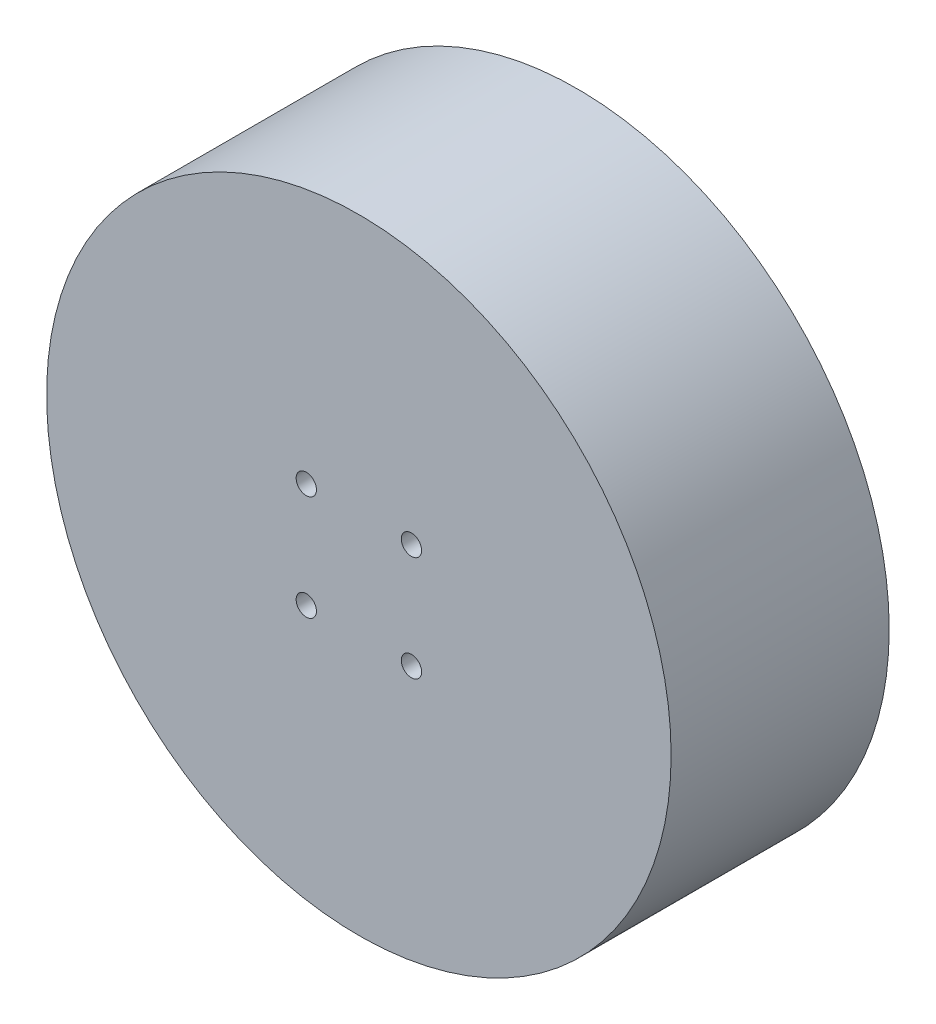
ISO-10303-21;
HEADER;
FILE_DESCRIPTION(('STEP AP214'),'2;1');
FILE_NAME('part.step','',(''),(''),'','','');
FILE_SCHEMA(('AUTOMOTIVE_DESIGN { 1 0 10303 214 1 1 1 1 }'));
ENDSEC;
DATA;
#1=APPLICATION_CONTEXT('core data for automotive mechanical design processes');
#2=APPLICATION_PROTOCOL_DEFINITION('international standard','automotive_design',2000,#1);
#3=PRODUCT_CONTEXT('',#1,'mechanical');
#4=PRODUCT('Part','Part','',(#3));
#5=PRODUCT_RELATED_PRODUCT_CATEGORY('part','',(#4));
#6=PRODUCT_DEFINITION_FORMATION('','',#4);
#7=PRODUCT_DEFINITION_CONTEXT('part definition',#1,'design');
#8=PRODUCT_DEFINITION('design','',#6,#7);
#9=PRODUCT_DEFINITION_SHAPE('','',#8);
#10=(LENGTH_UNIT() NAMED_UNIT(*) SI_UNIT(.MILLI.,.METRE.));
#11=(NAMED_UNIT(*) PLANE_ANGLE_UNIT() SI_UNIT($,.RADIAN.));
#12=(NAMED_UNIT(*) SI_UNIT($,.STERADIAN.) SOLID_ANGLE_UNIT());
#13=UNCERTAINTY_MEASURE_WITH_UNIT(LENGTH_MEASURE(1.E-05),#10,'distance_accuracy_value','');
#14=(GEOMETRIC_REPRESENTATION_CONTEXT(3) GLOBAL_UNCERTAINTY_ASSIGNED_CONTEXT((#13)) GLOBAL_UNIT_ASSIGNED_CONTEXT((#10,
#11,#12)) REPRESENTATION_CONTEXT('',''));
#15=CARTESIAN_POINT('',(0.,0.,0.));
#16=DIRECTION('',(0.,0.,1.));
#17=DIRECTION('',(1.,0.,0.));
#18=AXIS2_PLACEMENT_3D('',#15,#16,#17);
#19=CARTESIAN_POINT('',(0.,0.,22.));
#20=DIRECTION('',(0.,0.,-1.));
#21=DIRECTION('',(-1.,0.,0.));
#22=AXIS2_PLACEMENT_3D('',#19,#20,#21);
#23=CYLINDRICAL_SURFACE('',#22,31.5);
#24=CARTESIAN_POINT('',(0.,0.,22.));
#25=DIRECTION('',(0.,0.,1.));
#26=DIRECTION('',(1.,0.,0.));
#27=AXIS2_PLACEMENT_3D('',#24,#25,#26);
#28=CIRCLE('',#27,31.5);
#29=CARTESIAN_POINT('',(31.5,0.,22.));
#30=VERTEX_POINT('',#29);
#31=EDGE_CURVE('E11',#30,#30,#28,.T.);
#32=ORIENTED_EDGE('',*,*,#31,.F.);
#33=EDGE_LOOP('',(#32));
#34=FACE_BOUND('',#33,.T.);
#35=CARTESIAN_POINT('',(0.,0.,0.));
#36=DIRECTION('',(0.,0.,1.));
#37=DIRECTION('',(1.,0.,0.));
#38=AXIS2_PLACEMENT_3D('',#35,#36,#37);
#39=CIRCLE('',#38,31.5);
#40=CARTESIAN_POINT('',(31.5,0.,0.));
#41=VERTEX_POINT('',#40);
#42=EDGE_CURVE('E36',#41,#41,#39,.T.);
#43=ORIENTED_EDGE('',*,*,#42,.T.);
#44=EDGE_LOOP('',(#43));
#45=FACE_BOUND('',#44,.T.);
#46=ADVANCED_FACE('F33',(#34,#45),#23,.T.);
#47=CARTESIAN_POINT('',(0.,0.,22.));
#48=DIRECTION('',(0.,0.,1.));
#49=DIRECTION('',(1.,0.,0.));
#50=AXIS2_PLACEMENT_3D('',#47,#48,#49);
#51=PLANE('',#50);
#52=CARTESIAN_POINT('',(-5.30330085889911,5.30330085889911,22.));
#53=DIRECTION('',(0.,0.,1.));
#54=DIRECTION('',(1.,0.,0.));
#55=AXIS2_PLACEMENT_3D('',#52,#53,#54);
#56=CIRCLE('',#55,1.02499999999999);
#57=CARTESIAN_POINT('',(-4.27830085889912,5.30330085889911,22.));
#58=VERTEX_POINT('',#57);
#59=EDGE_CURVE('E98',#58,#58,#56,.T.);
#60=ORIENTED_EDGE('',*,*,#59,.F.);
#61=EDGE_LOOP('',(#60));
#62=FACE_BOUND('',#61,.T.);
#63=CARTESIAN_POINT('',(5.30330085889911,-5.30330085889911,22.));
#64=DIRECTION('',(0.,0.,1.));
#65=DIRECTION('',(1.,0.,0.));
#66=AXIS2_PLACEMENT_3D('',#63,#64,#65);
#67=CIRCLE('',#66,1.02499999999999);
#68=CARTESIAN_POINT('',(6.3283008588991,-5.30330085889911,22.));
#69=VERTEX_POINT('',#68);
#70=EDGE_CURVE('E104',#69,#69,#67,.T.);
#71=ORIENTED_EDGE('',*,*,#70,.F.);
#72=EDGE_LOOP('',(#71));
#73=FACE_BOUND('',#72,.T.);
#74=CARTESIAN_POINT('',(5.30330085889911,5.30330085889911,22.));
#75=DIRECTION('',(0.,0.,1.));
#76=DIRECTION('',(1.,0.,0.));
#77=AXIS2_PLACEMENT_3D('',#74,#75,#76);
#78=CIRCLE('',#77,1.02499999999999);
#79=CARTESIAN_POINT('',(6.3283008588991,5.30330085889911,22.));
#80=VERTEX_POINT('',#79);
#81=EDGE_CURVE('E110',#80,#80,#78,.T.);
#82=ORIENTED_EDGE('',*,*,#81,.F.);
#83=EDGE_LOOP('',(#82));
#84=FACE_BOUND('',#83,.T.);
#85=CARTESIAN_POINT('',(-5.30330085889911,-5.3033008588992,22.));
#86=DIRECTION('',(0.,0.,1.));
#87=DIRECTION('',(1.,0.,0.));
#88=AXIS2_PLACEMENT_3D('',#85,#86,#87);
#89=CIRCLE('',#88,1.02499999999999);
#90=CARTESIAN_POINT('',(-4.27830085889912,-5.3033008588992,22.));
#91=VERTEX_POINT('',#90);
#92=EDGE_CURVE('E116',#91,#91,#89,.T.);
#93=ORIENTED_EDGE('',*,*,#92,.F.);
#94=EDGE_LOOP('',(#93));
#95=FACE_BOUND('',#94,.T.);
#96=ORIENTED_EDGE('',*,*,#31,.T.);
#97=EDGE_LOOP('',(#96));
#98=FACE_BOUND('',#97,.T.);
#99=ADVANCED_FACE('F130',(#62,#73,#84,#95,#98),#51,.T.);
#100=CARTESIAN_POINT('',(0.,0.,0.));
#101=DIRECTION('',(0.,0.,1.));
#102=DIRECTION('',(1.,0.,0.));
#103=AXIS2_PLACEMENT_3D('',#100,#101,#102);
#104=PLANE('',#103);
#105=CARTESIAN_POINT('',(-8.83883476483184,8.83883476483184,0.));
#106=DIRECTION('',(0.,0.,-1.));
#107=DIRECTION('',(-1.,0.,0.));
#108=AXIS2_PLACEMENT_3D('',#105,#106,#107);
#109=CIRCLE('',#108,1.25);
#110=CARTESIAN_POINT('',(-10.0888347648318,8.83883476483184,0.));
#111=VERTEX_POINT('',#110);
#112=EDGE_CURVE('E76',#111,#111,#109,.T.);
#113=ORIENTED_EDGE('',*,*,#112,.F.);
#114=EDGE_LOOP('',(#113));
#115=FACE_BOUND('',#114,.T.);
#116=CARTESIAN_POINT('',(-8.83883476483184,-8.83883476483184,0.));
#117=DIRECTION('',(0.,0.,-1.));
#118=DIRECTION('',(-1.,0.,0.));
#119=AXIS2_PLACEMENT_3D('',#116,#117,#118);
#120=CIRCLE('',#119,1.25);
#121=CARTESIAN_POINT('',(-10.0888347648318,-8.83883476483184,0.));
#122=VERTEX_POINT('',#121);
#123=EDGE_CURVE('E75',#122,#122,#120,.T.);
#124=ORIENTED_EDGE('',*,*,#123,.F.);
#125=EDGE_LOOP('',(#124));
#126=FACE_BOUND('',#125,.T.);
#127=CARTESIAN_POINT('',(8.83883476483184,8.83883476483184,0.));
#128=DIRECTION('',(0.,0.,-1.));
#129=DIRECTION('',(-1.,0.,0.));
#130=AXIS2_PLACEMENT_3D('',#127,#128,#129);
#131=CIRCLE('',#130,1.25);
#132=CARTESIAN_POINT('',(7.58883476483184,8.83883476483184,0.));
#133=VERTEX_POINT('',#132);
#134=EDGE_CURVE('E86',#133,#133,#131,.T.);
#135=ORIENTED_EDGE('',*,*,#134,.F.);
#136=EDGE_LOOP('',(#135));
#137=FACE_BOUND('',#136,.T.);
#138=CARTESIAN_POINT('',(8.83883476483184,-8.83883476483184,0.));
#139=DIRECTION('',(0.,0.,-1.));
#140=DIRECTION('',(-1.,0.,0.));
#141=AXIS2_PLACEMENT_3D('',#138,#139,#140);
#142=CIRCLE('',#141,1.25);
#143=CARTESIAN_POINT('',(7.58883476483184,-8.83883476483184,0.));
#144=VERTEX_POINT('',#143);
#145=EDGE_CURVE('E92',#144,#144,#142,.T.);
#146=ORIENTED_EDGE('',*,*,#145,.F.);
#147=EDGE_LOOP('',(#146));
#148=FACE_BOUND('',#147,.T.);
#149=ORIENTED_EDGE('',*,*,#42,.F.);
#150=EDGE_LOOP('',(#149));
#151=FACE_BOUND('',#150,.T.);
#152=ADVANCED_FACE('F127',(#115,#126,#137,#148,#151),#104,.F.);
#153=CARTESIAN_POINT('',(-5.30330085889911,-5.3033008588992,16.5));
#154=DIRECTION('',(0.,0.,1.));
#155=DIRECTION('',(1.,0.,0.));
#156=AXIS2_PLACEMENT_3D('',#153,#154,#155);
#157=CONICAL_SURFACE('',#156,1.025,1.02974425867665);
#158=CARTESIAN_POINT('',(-5.30330085889911,-5.3033008588992,15.8841178654968));
#159=VERTEX_POINT('',#158);
#160=VERTEX_LOOP('',#159);
#161=FACE_BOUND('',#160,.T.);
#162=CARTESIAN_POINT('',(-5.30330085889911,-5.3033008588992,16.5));
#163=DIRECTION('',(0.,0.,1.));
#164=DIRECTION('',(1.,0.,0.));
#165=AXIS2_PLACEMENT_3D('',#162,#163,#164);
#166=CIRCLE('',#165,1.025);
#167=CARTESIAN_POINT('',(-4.27830085889911,-5.3033008588992,16.5));
#168=VERTEX_POINT('',#167);
#169=EDGE_CURVE('E119',#168,#168,#166,.T.);
#170=ORIENTED_EDGE('',*,*,#169,.T.);
#171=EDGE_LOOP('',(#170));
#172=FACE_BOUND('',#171,.T.);
#173=ADVANCED_FACE('F129',(#161,#172),#157,.F.);
#174=CARTESIAN_POINT('',(-5.30330085889911,-5.3033008588992,22.));
#175=DIRECTION('',(0.,0.,1.));
#176=DIRECTION('',(1.,0.,0.));
#177=AXIS2_PLACEMENT_3D('',#174,#175,#176);
#178=CYLINDRICAL_SURFACE('',#177,1.02499999999999);
#179=ORIENTED_EDGE('',*,*,#169,.F.);
#180=EDGE_LOOP('',(#179));
#181=FACE_BOUND('',#180,.T.);
#182=ORIENTED_EDGE('',*,*,#92,.T.);
#183=EDGE_LOOP('',(#182));
#184=FACE_BOUND('',#183,.T.);
#185=ADVANCED_FACE('F136',(#181,#184),#178,.F.);
#186=CARTESIAN_POINT('',(5.30330085889911,5.30330085889911,16.5));
#187=DIRECTION('',(0.,0.,1.));
#188=DIRECTION('',(1.,0.,0.));
#189=AXIS2_PLACEMENT_3D('',#186,#187,#188);
#190=CONICAL_SURFACE('',#189,1.025,1.02974425867665);
#191=CARTESIAN_POINT('',(5.3033008588991,5.30330085889911,15.8841178654968));
#192=VERTEX_POINT('',#191);
#193=VERTEX_LOOP('',#192);
#194=FACE_BOUND('',#193,.T.);
#195=CARTESIAN_POINT('',(5.30330085889911,5.30330085889911,16.5));
#196=DIRECTION('',(0.,0.,1.));
#197=DIRECTION('',(1.,0.,0.));
#198=AXIS2_PLACEMENT_3D('',#195,#196,#197);
#199=CIRCLE('',#198,1.025);
#200=CARTESIAN_POINT('',(6.3283008588991,5.30330085889911,16.5));
#201=VERTEX_POINT('',#200);
#202=EDGE_CURVE('E113',#201,#201,#199,.T.);
#203=ORIENTED_EDGE('',*,*,#202,.T.);
#204=EDGE_LOOP('',(#203));
#205=FACE_BOUND('',#204,.T.);
#206=ADVANCED_FACE('F168',(#194,#205),#190,.F.);
#207=CARTESIAN_POINT('',(5.30330085889911,5.30330085889911,22.));
#208=DIRECTION('',(0.,0.,1.));
#209=DIRECTION('',(1.,0.,0.));
#210=AXIS2_PLACEMENT_3D('',#207,#208,#209);
#211=CYLINDRICAL_SURFACE('',#210,1.02499999999999);
#212=ORIENTED_EDGE('',*,*,#202,.F.);
#213=EDGE_LOOP('',(#212));
#214=FACE_BOUND('',#213,.T.);
#215=ORIENTED_EDGE('',*,*,#81,.T.);
#216=EDGE_LOOP('',(#215));
#217=FACE_BOUND('',#216,.T.);
#218=ADVANCED_FACE('F178',(#214,#217),#211,.F.);
#219=CARTESIAN_POINT('',(5.30330085889911,-5.30330085889911,16.5));
#220=DIRECTION('',(0.,0.,1.));
#221=DIRECTION('',(1.,0.,0.));
#222=AXIS2_PLACEMENT_3D('',#219,#220,#221);
#223=CONICAL_SURFACE('',#222,1.025,1.02974425867665);
#224=CARTESIAN_POINT('',(5.3033008588991,-5.30330085889911,15.8841178654968));
#225=VERTEX_POINT('',#224);
#226=VERTEX_LOOP('',#225);
#227=FACE_BOUND('',#226,.T.);
#228=CARTESIAN_POINT('',(5.30330085889911,-5.30330085889911,16.5));
#229=DIRECTION('',(0.,0.,1.));
#230=DIRECTION('',(1.,0.,0.));
#231=AXIS2_PLACEMENT_3D('',#228,#229,#230);
#232=CIRCLE('',#231,1.025);
#233=CARTESIAN_POINT('',(6.3283008588991,-5.30330085889911,16.5));
#234=VERTEX_POINT('',#233);
#235=EDGE_CURVE('E107',#234,#234,#232,.T.);
#236=ORIENTED_EDGE('',*,*,#235,.T.);
#237=EDGE_LOOP('',(#236));
#238=FACE_BOUND('',#237,.T.);
#239=ADVANCED_FACE('F187',(#227,#238),#223,.F.);
#240=CARTESIAN_POINT('',(5.30330085889911,-5.30330085889911,22.));
#241=DIRECTION('',(0.,0.,1.));
#242=DIRECTION('',(1.,0.,0.));
#243=AXIS2_PLACEMENT_3D('',#240,#241,#242);
#244=CYLINDRICAL_SURFACE('',#243,1.02499999999999);
#245=ORIENTED_EDGE('',*,*,#235,.F.);
#246=EDGE_LOOP('',(#245));
#247=FACE_BOUND('',#246,.T.);
#248=ORIENTED_EDGE('',*,*,#70,.T.);
#249=EDGE_LOOP('',(#248));
#250=FACE_BOUND('',#249,.T.);
#251=ADVANCED_FACE('F197',(#247,#250),#244,.F.);
#252=CARTESIAN_POINT('',(-5.30330085889911,5.30330085889911,16.5));
#253=DIRECTION('',(0.,0.,1.));
#254=DIRECTION('',(1.,0.,0.));
#255=AXIS2_PLACEMENT_3D('',#252,#253,#254);
#256=CONICAL_SURFACE('',#255,1.025,1.02974425867665);
#257=CARTESIAN_POINT('',(-5.30330085889911,5.30330085889911,15.8841178654968));
#258=VERTEX_POINT('',#257);
#259=VERTEX_LOOP('',#258);
#260=FACE_BOUND('',#259,.T.);
#261=CARTESIAN_POINT('',(-5.30330085889911,5.30330085889911,16.5));
#262=DIRECTION('',(0.,0.,1.));
#263=DIRECTION('',(1.,0.,0.));
#264=AXIS2_PLACEMENT_3D('',#261,#262,#263);
#265=CIRCLE('',#264,1.025);
#266=CARTESIAN_POINT('',(-4.27830085889911,5.30330085889911,16.5));
#267=VERTEX_POINT('',#266);
#268=EDGE_CURVE('E101',#267,#267,#265,.T.);
#269=ORIENTED_EDGE('',*,*,#268,.T.);
#270=EDGE_LOOP('',(#269));
#271=FACE_BOUND('',#270,.T.);
#272=ADVANCED_FACE('F207',(#260,#271),#256,.F.);
#273=CARTESIAN_POINT('',(-5.30330085889911,5.30330085889911,22.));
#274=DIRECTION('',(0.,0.,1.));
#275=DIRECTION('',(1.,0.,0.));
#276=AXIS2_PLACEMENT_3D('',#273,#274,#275);
#277=CYLINDRICAL_SURFACE('',#276,1.02499999999999);
#278=ORIENTED_EDGE('',*,*,#268,.F.);
#279=EDGE_LOOP('',(#278));
#280=FACE_BOUND('',#279,.T.);
#281=ORIENTED_EDGE('',*,*,#59,.T.);
#282=EDGE_LOOP('',(#281));
#283=FACE_BOUND('',#282,.T.);
#284=ADVANCED_FACE('F217',(#280,#283),#277,.F.);
#285=CARTESIAN_POINT('',(8.83883476483184,-8.83883476483184,5.5));
#286=DIRECTION('',(0.,0.,-1.));
#287=DIRECTION('',(-1.,0.,0.));
#288=AXIS2_PLACEMENT_3D('',#285,#286,#287);
#289=CONICAL_SURFACE('',#288,1.25,1.02974425867665);
#290=CARTESIAN_POINT('',(8.83883476483184,-8.83883476483184,6.25107577378445));
#291=VERTEX_POINT('',#290);
#292=VERTEX_LOOP('',#291);
#293=FACE_BOUND('',#292,.T.);
#294=CARTESIAN_POINT('',(8.83883476483184,-8.83883476483184,5.5));
#295=DIRECTION('',(0.,0.,-1.));
#296=DIRECTION('',(-1.,0.,0.));
#297=AXIS2_PLACEMENT_3D('',#294,#295,#296);
#298=CIRCLE('',#297,1.25);
#299=CARTESIAN_POINT('',(7.58883476483184,-8.83883476483184,5.5));
#300=VERTEX_POINT('',#299);
#301=EDGE_CURVE('E95',#300,#300,#298,.T.);
#302=ORIENTED_EDGE('',*,*,#301,.T.);
#303=EDGE_LOOP('',(#302));
#304=FACE_BOUND('',#303,.T.);
#305=ADVANCED_FACE('F226',(#293,#304),#289,.F.);
#306=CARTESIAN_POINT('',(8.83883476483184,-8.83883476483184,0.));
#307=DIRECTION('',(0.,0.,-1.));
#308=DIRECTION('',(-1.,0.,0.));
#309=AXIS2_PLACEMENT_3D('',#306,#307,#308);
#310=CYLINDRICAL_SURFACE('',#309,1.25);
#311=ORIENTED_EDGE('',*,*,#301,.F.);
#312=EDGE_LOOP('',(#311));
#313=FACE_BOUND('',#312,.T.);
#314=ORIENTED_EDGE('',*,*,#145,.T.);
#315=EDGE_LOOP('',(#314));
#316=FACE_BOUND('',#315,.T.);
#317=ADVANCED_FACE('F240',(#313,#316),#310,.F.);
#318=CARTESIAN_POINT('',(8.83883476483184,8.83883476483184,5.5));
#319=DIRECTION('',(0.,0.,-1.));
#320=DIRECTION('',(-1.,0.,0.));
#321=AXIS2_PLACEMENT_3D('',#318,#319,#320);
#322=CONICAL_SURFACE('',#321,1.25,1.02974425867665);
#323=CARTESIAN_POINT('',(8.83883476483184,8.83883476483184,6.25107577378445));
#324=VERTEX_POINT('',#323);
#325=VERTEX_LOOP('',#324);
#326=FACE_BOUND('',#325,.T.);
#327=CARTESIAN_POINT('',(8.83883476483184,8.83883476483184,5.5));
#328=DIRECTION('',(0.,0.,-1.));
#329=DIRECTION('',(-1.,0.,0.));
#330=AXIS2_PLACEMENT_3D('',#327,#328,#329);
#331=CIRCLE('',#330,1.25);
#332=CARTESIAN_POINT('',(7.58883476483184,8.83883476483184,5.5));
#333=VERTEX_POINT('',#332);
#334=EDGE_CURVE('E89',#333,#333,#331,.T.);
#335=ORIENTED_EDGE('',*,*,#334,.T.);
#336=EDGE_LOOP('',(#335));
#337=FACE_BOUND('',#336,.T.);
#338=ADVANCED_FACE('F250',(#326,#337),#322,.F.);
#339=CARTESIAN_POINT('',(8.83883476483184,8.83883476483184,0.));
#340=DIRECTION('',(0.,0.,-1.));
#341=DIRECTION('',(-1.,0.,0.));
#342=AXIS2_PLACEMENT_3D('',#339,#340,#341);
#343=CYLINDRICAL_SURFACE('',#342,1.25);
#344=ORIENTED_EDGE('',*,*,#334,.F.);
#345=EDGE_LOOP('',(#344));
#346=FACE_BOUND('',#345,.T.);
#347=ORIENTED_EDGE('',*,*,#134,.T.);
#348=EDGE_LOOP('',(#347));
#349=FACE_BOUND('',#348,.T.);
#350=ADVANCED_FACE('F260',(#346,#349),#343,.F.);
#351=CARTESIAN_POINT('',(-8.83883476483184,-8.83883476483184,5.5));
#352=DIRECTION('',(0.,0.,-1.));
#353=DIRECTION('',(-1.,0.,0.));
#354=AXIS2_PLACEMENT_3D('',#351,#352,#353);
#355=CONICAL_SURFACE('',#354,1.25,1.02974425867665);
#356=CARTESIAN_POINT('',(-8.83883476483185,-8.83883476483184,6.25107577378445));
#357=VERTEX_POINT('',#356);
#358=VERTEX_LOOP('',#357);
#359=FACE_BOUND('',#358,.T.);
#360=CARTESIAN_POINT('',(-8.83883476483184,-8.83883476483184,5.5));
#361=DIRECTION('',(0.,0.,-1.));
#362=DIRECTION('',(-1.,0.,0.));
#363=AXIS2_PLACEMENT_3D('',#360,#361,#362);
#364=CIRCLE('',#363,1.25);
#365=CARTESIAN_POINT('',(-10.0888347648318,-8.83883476483184,5.5));
#366=VERTEX_POINT('',#365);
#367=EDGE_CURVE('E79',#366,#366,#364,.T.);
#368=ORIENTED_EDGE('',*,*,#367,.T.);
#369=EDGE_LOOP('',(#368));
#370=FACE_BOUND('',#369,.T.);
#371=ADVANCED_FACE('F270',(#359,#370),#355,.F.);
#372=CARTESIAN_POINT('',(-8.83883476483184,-8.83883476483184,0.));
#373=DIRECTION('',(0.,0.,-1.));
#374=DIRECTION('',(-1.,0.,0.));
#375=AXIS2_PLACEMENT_3D('',#372,#373,#374);
#376=CYLINDRICAL_SURFACE('',#375,1.25);
#377=ORIENTED_EDGE('',*,*,#367,.F.);
#378=EDGE_LOOP('',(#377));
#379=FACE_BOUND('',#378,.T.);
#380=ORIENTED_EDGE('',*,*,#123,.T.);
#381=EDGE_LOOP('',(#380));
#382=FACE_BOUND('',#381,.T.);
#383=ADVANCED_FACE('F69',(#379,#382),#376,.F.);
#384=CARTESIAN_POINT('',(-8.83883476483184,8.83883476483184,5.5));
#385=DIRECTION('',(0.,0.,-1.));
#386=DIRECTION('',(-1.,0.,0.));
#387=AXIS2_PLACEMENT_3D('',#384,#385,#386);
#388=CONICAL_SURFACE('',#387,1.25,1.02974425867665);
#389=CARTESIAN_POINT('',(-8.83883476483185,8.83883476483184,6.25107577378445));
#390=VERTEX_POINT('',#389);
#391=VERTEX_LOOP('',#390);
#392=FACE_BOUND('',#391,.T.);
#393=CARTESIAN_POINT('',(-8.83883476483184,8.83883476483184,5.5));
#394=DIRECTION('',(0.,0.,-1.));
#395=DIRECTION('',(-1.,0.,0.));
#396=AXIS2_PLACEMENT_3D('',#393,#394,#395);
#397=CIRCLE('',#396,1.25);
#398=CARTESIAN_POINT('',(-10.0888347648318,8.83883476483184,5.5));
#399=VERTEX_POINT('',#398);
#400=EDGE_CURVE('E73',#399,#399,#397,.T.);
#401=ORIENTED_EDGE('',*,*,#400,.T.);
#402=EDGE_LOOP('',(#401));
#403=FACE_BOUND('',#402,.T.);
#404=ADVANCED_FACE('F65',(#392,#403),#388,.F.);
#405=CARTESIAN_POINT('',(-8.83883476483184,8.83883476483184,0.));
#406=DIRECTION('',(0.,0.,-1.));
#407=DIRECTION('',(-1.,0.,0.));
#408=AXIS2_PLACEMENT_3D('',#405,#406,#407);
#409=CYLINDRICAL_SURFACE('',#408,1.25);
#410=ORIENTED_EDGE('',*,*,#400,.F.);
#411=EDGE_LOOP('',(#410));
#412=FACE_BOUND('',#411,.T.);
#413=ORIENTED_EDGE('',*,*,#112,.T.);
#414=EDGE_LOOP('',(#413));
#415=FACE_BOUND('',#414,.T.);
#416=ADVANCED_FACE('F68',(#412,#415),#409,.F.);
#417=CLOSED_SHELL('',(#46,#99,#152,#173,#185,#206,#218,#239,#251,#272,#284,#305,#317,#338,#350,
#371,#383,#404,#416));
#418=MANIFOLD_SOLID_BREP('B2',#417);
#419=ADVANCED_BREP_SHAPE_REPRESENTATION('',(#18,#418),#14);
#420=SHAPE_DEFINITION_REPRESENTATION(#9,#419);
ENDSEC;
END-ISO-10303-21;
